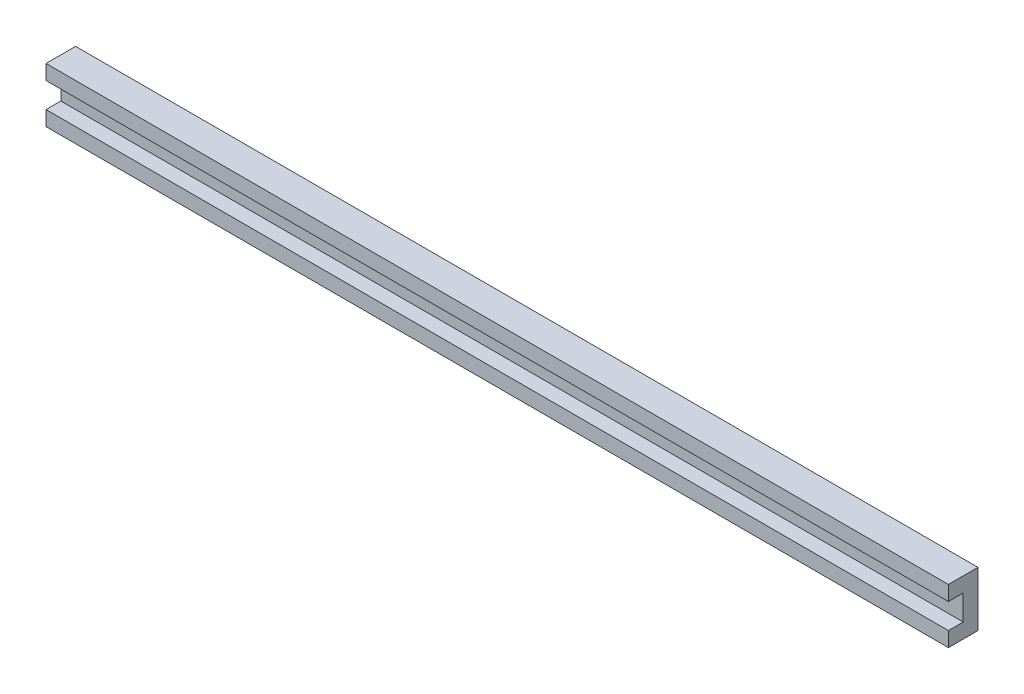
ISO-10303-21;
HEADER;
FILE_DESCRIPTION(('STEP AP214'),'2;1');
FILE_NAME('part.step','',(''),(''),'','','');
FILE_SCHEMA(('AUTOMOTIVE_DESIGN { 1 0 10303 214 1 1 1 1 }'));
ENDSEC;
DATA;
#1=APPLICATION_CONTEXT('core data for automotive mechanical design processes');
#2=APPLICATION_PROTOCOL_DEFINITION('international standard','automotive_design',2000,#1);
#3=PRODUCT_CONTEXT('',#1,'mechanical');
#4=PRODUCT('Part','Part','',(#3));
#5=PRODUCT_RELATED_PRODUCT_CATEGORY('part','',(#4));
#6=PRODUCT_DEFINITION_FORMATION('','',#4);
#7=PRODUCT_DEFINITION_CONTEXT('part definition',#1,'design');
#8=PRODUCT_DEFINITION('design','',#6,#7);
#9=PRODUCT_DEFINITION_SHAPE('','',#8);
#10=(LENGTH_UNIT() NAMED_UNIT(*) SI_UNIT(.MILLI.,.METRE.));
#11=(NAMED_UNIT(*) PLANE_ANGLE_UNIT() SI_UNIT($,.RADIAN.));
#12=(NAMED_UNIT(*) SI_UNIT($,.STERADIAN.) SOLID_ANGLE_UNIT());
#13=UNCERTAINTY_MEASURE_WITH_UNIT(LENGTH_MEASURE(1.E-05),#10,'distance_accuracy_value','');
#14=(GEOMETRIC_REPRESENTATION_CONTEXT(3) GLOBAL_UNCERTAINTY_ASSIGNED_CONTEXT((#13)) GLOBAL_UNIT_ASSIGNED_CONTEXT((#10,
#11,#12)) REPRESENTATION_CONTEXT('',''));
#15=CARTESIAN_POINT('',(0.,0.,0.));
#16=DIRECTION('',(0.,0.,1.));
#17=DIRECTION('',(1.,0.,0.));
#18=AXIS2_PLACEMENT_3D('',#15,#16,#17);
#19=CARTESIAN_POINT('',(1549.4,0.,0.));
#20=DIRECTION('',(0.,0.,-1.));
#21=DIRECTION('',(-1.,0.,0.));
#22=AXIS2_PLACEMENT_3D('',#19,#20,#21);
#23=PLANE('',#22);
#24=DIRECTION('',(0.,-1.,0.));
#25=VECTOR('',#24,1.);
#26=CARTESIAN_POINT('',(0.,0.,0.));
#27=LINE('',#26,#25);
#28=CARTESIAN_POINT('',(0.,25.4,0.));
#29=VERTEX_POINT('',#28);
#30=CARTESIAN_POINT('',(0.,0.,0.));
#31=VERTEX_POINT('',#30);
#32=EDGE_CURVE('E129',#29,#31,#27,.T.);
#33=ORIENTED_EDGE('',*,*,#32,.T.);
#34=DIRECTION('',(-1.,0.,0.));
#35=VECTOR('',#34,1.);
#36=CARTESIAN_POINT('',(1549.4,0.,0.));
#37=LINE('',#36,#35);
#38=CARTESIAN_POINT('',(1549.4,0.,0.));
#39=VERTEX_POINT('',#38);
#40=EDGE_CURVE('E11',#39,#31,#37,.T.);
#41=ORIENTED_EDGE('',*,*,#40,.F.);
#42=DIRECTION('',(0.,-1.,0.));
#43=VECTOR('',#42,1.);
#44=CARTESIAN_POINT('',(1549.4,0.,0.));
#45=LINE('',#44,#43);
#46=CARTESIAN_POINT('',(1549.4,25.4,0.));
#47=VERTEX_POINT('',#46);
#48=EDGE_CURVE('E143',#47,#39,#45,.T.);
#49=ORIENTED_EDGE('',*,*,#48,.F.);
#50=DIRECTION('',(-1.,0.,0.));
#51=VECTOR('',#50,1.);
#52=CARTESIAN_POINT('',(1549.4,25.4,0.));
#53=LINE('',#52,#51);
#54=EDGE_CURVE('E125',#47,#29,#53,.T.);
#55=ORIENTED_EDGE('',*,*,#54,.T.);
#56=EDGE_LOOP('',(#33,#41,#49,#55));
#57=FACE_BOUND('',#56,.T.);
#58=ADVANCED_FACE('F33',(#57),#23,.F.);
#59=CARTESIAN_POINT('',(1549.4,0.,0.));
#60=DIRECTION('',(0.,1.,0.));
#61=DIRECTION('',(0.,0.,1.));
#62=AXIS2_PLACEMENT_3D('',#59,#60,#61);
#63=PLANE('',#62);
#64=DIRECTION('',(0.,0.,-1.));
#65=VECTOR('',#64,1.);
#66=CARTESIAN_POINT('',(0.,0.,0.));
#67=LINE('',#66,#65);
#68=CARTESIAN_POINT('',(0.,0.,-50.8));
#69=VERTEX_POINT('',#68);
#70=EDGE_CURVE('E132',#31,#69,#67,.T.);
#71=ORIENTED_EDGE('',*,*,#70,.T.);
#72=DIRECTION('',(-1.,0.,0.));
#73=VECTOR('',#72,1.);
#74=CARTESIAN_POINT('',(1549.4,0.,-50.8));
#75=LINE('',#74,#73);
#76=CARTESIAN_POINT('',(1549.4,0.,-50.8));
#77=VERTEX_POINT('',#76);
#78=EDGE_CURVE('E41',#77,#69,#75,.T.);
#79=ORIENTED_EDGE('',*,*,#78,.F.);
#80=DIRECTION('',(0.,0.,-1.));
#81=VECTOR('',#80,1.);
#82=CARTESIAN_POINT('',(1549.4,0.,0.));
#83=LINE('',#82,#81);
#84=EDGE_CURVE('E92',#39,#77,#83,.T.);
#85=ORIENTED_EDGE('',*,*,#84,.F.);
#86=ORIENTED_EDGE('',*,*,#40,.T.);
#87=EDGE_LOOP('',(#71,#79,#85,#86));
#88=FACE_BOUND('',#87,.T.);
#89=ADVANCED_FACE('F178',(#88),#63,.F.);
#90=CARTESIAN_POINT('',(1549.4,0.,-50.8));
#91=DIRECTION('',(0.,0.,1.));
#92=DIRECTION('',(0.,-1.,0.));
#93=AXIS2_PLACEMENT_3D('',#90,#91,#92);
#94=PLANE('',#93);
#95=DIRECTION('',(0.,1.,0.));
#96=VECTOR('',#95,1.);
#97=CARTESIAN_POINT('',(0.,0.,-50.8));
#98=LINE('',#97,#96);
#99=CARTESIAN_POINT('',(0.,93.98,-50.8));
#100=VERTEX_POINT('',#99);
#101=EDGE_CURVE('E134',#69,#100,#98,.T.);
#102=ORIENTED_EDGE('',*,*,#101,.T.);
#103=DIRECTION('',(-1.,0.,0.));
#104=VECTOR('',#103,1.);
#105=CARTESIAN_POINT('',(1549.4,93.98,-50.8));
#106=LINE('',#105,#104);
#107=CARTESIAN_POINT('',(1549.4,93.98,-50.8));
#108=VERTEX_POINT('',#107);
#109=EDGE_CURVE('E150',#108,#100,#106,.T.);
#110=ORIENTED_EDGE('',*,*,#109,.F.);
#111=DIRECTION('',(0.,1.,0.));
#112=VECTOR('',#111,1.);
#113=CARTESIAN_POINT('',(1549.4,0.,-50.8));
#114=LINE('',#113,#112);
#115=EDGE_CURVE('E158',#77,#108,#114,.T.);
#116=ORIENTED_EDGE('',*,*,#115,.F.);
#117=ORIENTED_EDGE('',*,*,#78,.T.);
#118=EDGE_LOOP('',(#102,#110,#116,#117));
#119=FACE_BOUND('',#118,.T.);
#120=ADVANCED_FACE('F156',(#119),#94,.F.);
#121=CARTESIAN_POINT('',(1549.4,93.98,-50.8));
#122=DIRECTION('',(0.,-1.,0.));
#123=DIRECTION('',(0.,0.,-1.));
#124=AXIS2_PLACEMENT_3D('',#121,#122,#123);
#125=PLANE('',#124);
#126=DIRECTION('',(0.,0.,1.));
#127=VECTOR('',#126,1.);
#128=CARTESIAN_POINT('',(0.,93.98,-50.8));
#129=LINE('',#128,#127);
#130=CARTESIAN_POINT('',(0.,93.98,0.));
#131=VERTEX_POINT('',#130);
#132=EDGE_CURVE('E136',#100,#131,#129,.T.);
#133=ORIENTED_EDGE('',*,*,#132,.T.);
#134=DIRECTION('',(-1.,0.,0.));
#135=VECTOR('',#134,1.);
#136=CARTESIAN_POINT('',(1549.4,93.98,0.));
#137=LINE('',#136,#135);
#138=CARTESIAN_POINT('',(1549.4,93.98,0.));
#139=VERTEX_POINT('',#138);
#140=EDGE_CURVE('E147',#139,#131,#137,.T.);
#141=ORIENTED_EDGE('',*,*,#140,.F.);
#142=DIRECTION('',(0.,0.,1.));
#143=VECTOR('',#142,1.);
#144=CARTESIAN_POINT('',(1549.4,93.98,-50.8));
#145=LINE('',#144,#143);
#146=EDGE_CURVE('E170',#108,#139,#145,.T.);
#147=ORIENTED_EDGE('',*,*,#146,.F.);
#148=ORIENTED_EDGE('',*,*,#109,.T.);
#149=EDGE_LOOP('',(#133,#141,#147,#148));
#150=FACE_BOUND('',#149,.T.);
#151=ADVANCED_FACE('F166',(#150),#125,.F.);
#152=CARTESIAN_POINT('',(1549.4,93.98,0.));
#153=DIRECTION('',(0.,0.,-1.));
#154=DIRECTION('',(0.,1.,0.));
#155=AXIS2_PLACEMENT_3D('',#152,#153,#154);
#156=PLANE('',#155);
#157=DIRECTION('',(0.,-1.,0.));
#158=VECTOR('',#157,1.);
#159=CARTESIAN_POINT('',(0.,93.98,0.));
#160=LINE('',#159,#158);
#161=CARTESIAN_POINT('',(0.,68.58,0.));
#162=VERTEX_POINT('',#161);
#163=EDGE_CURVE('E138',#131,#162,#160,.T.);
#164=ORIENTED_EDGE('',*,*,#163,.T.);
#165=DIRECTION('',(-1.,0.,0.));
#166=VECTOR('',#165,1.);
#167=CARTESIAN_POINT('',(1549.4,68.58,0.));
#168=LINE('',#167,#166);
#169=CARTESIAN_POINT('',(1549.4,68.58,0.));
#170=VERTEX_POINT('',#169);
#171=EDGE_CURVE('E120',#170,#162,#168,.T.);
#172=ORIENTED_EDGE('',*,*,#171,.F.);
#173=DIRECTION('',(0.,-1.,0.));
#174=VECTOR('',#173,1.);
#175=CARTESIAN_POINT('',(1549.4,93.98,0.));
#176=LINE('',#175,#174);
#177=EDGE_CURVE('E111',#139,#170,#176,.T.);
#178=ORIENTED_EDGE('',*,*,#177,.F.);
#179=ORIENTED_EDGE('',*,*,#140,.T.);
#180=EDGE_LOOP('',(#164,#172,#178,#179));
#181=FACE_BOUND('',#180,.T.);
#182=ADVANCED_FACE('F169',(#181),#156,.F.);
#183=CARTESIAN_POINT('',(1549.4,68.58,-25.4));
#184=DIRECTION('',(0.,1.,0.));
#185=DIRECTION('',(0.,0.,1.));
#186=AXIS2_PLACEMENT_3D('',#183,#184,#185);
#187=PLANE('',#186);
#188=DIRECTION('',(0.,0.,-1.));
#189=VECTOR('',#188,1.);
#190=CARTESIAN_POINT('',(0.,68.58,-25.4));
#191=LINE('',#190,#189);
#192=CARTESIAN_POINT('',(0.,68.58,-25.4));
#193=VERTEX_POINT('',#192);
#194=EDGE_CURVE('E119',#162,#193,#191,.T.);
#195=ORIENTED_EDGE('',*,*,#194,.T.);
#196=DIRECTION('',(-1.,0.,0.));
#197=VECTOR('',#196,1.);
#198=CARTESIAN_POINT('',(1549.4,68.58,-25.4));
#199=LINE('',#198,#197);
#200=CARTESIAN_POINT('',(1549.4,68.58,-25.4));
#201=VERTEX_POINT('',#200);
#202=EDGE_CURVE('E116',#201,#193,#199,.T.);
#203=ORIENTED_EDGE('',*,*,#202,.F.);
#204=DIRECTION('',(0.,0.,-1.));
#205=VECTOR('',#204,1.);
#206=CARTESIAN_POINT('',(1549.4,68.58,-25.4));
#207=LINE('',#206,#205);
#208=EDGE_CURVE('E105',#170,#201,#207,.T.);
#209=ORIENTED_EDGE('',*,*,#208,.F.);
#210=ORIENTED_EDGE('',*,*,#171,.T.);
#211=EDGE_LOOP('',(#195,#203,#209,#210));
#212=FACE_BOUND('',#211,.T.);
#213=ADVANCED_FACE('F117',(#212),#187,.F.);
#214=CARTESIAN_POINT('',(1549.4,25.4,-25.4));
#215=DIRECTION('',(0.,0.,-1.));
#216=DIRECTION('',(-1.,0.,0.));
#217=AXIS2_PLACEMENT_3D('',#214,#215,#216);
#218=PLANE('',#217);
#219=DIRECTION('',(0.,-1.,0.));
#220=VECTOR('',#219,1.);
#221=CARTESIAN_POINT('',(0.,25.4,-25.4));
#222=LINE('',#221,#220);
#223=CARTESIAN_POINT('',(0.,25.4,-25.4));
#224=VERTEX_POINT('',#223);
#225=EDGE_CURVE('E78',#193,#224,#222,.T.);
#226=ORIENTED_EDGE('',*,*,#225,.T.);
#227=DIRECTION('',(-1.,0.,0.));
#228=VECTOR('',#227,1.);
#229=CARTESIAN_POINT('',(1549.4,25.4,-25.4));
#230=LINE('',#229,#228);
#231=CARTESIAN_POINT('',(1549.4,25.4,-25.4));
#232=VERTEX_POINT('',#231);
#233=EDGE_CURVE('E121',#232,#224,#230,.T.);
#234=ORIENTED_EDGE('',*,*,#233,.F.);
#235=DIRECTION('',(0.,-1.,0.));
#236=VECTOR('',#235,1.);
#237=CARTESIAN_POINT('',(1549.4,25.4,-25.4));
#238=LINE('',#237,#236);
#239=EDGE_CURVE('E109',#201,#232,#238,.T.);
#240=ORIENTED_EDGE('',*,*,#239,.F.);
#241=ORIENTED_EDGE('',*,*,#202,.T.);
#242=EDGE_LOOP('',(#226,#234,#240,#241));
#243=FACE_BOUND('',#242,.T.);
#244=ADVANCED_FACE('F123',(#243),#218,.F.);
#245=CARTESIAN_POINT('',(1549.4,25.4,0.));
#246=DIRECTION('',(0.,-1.,0.));
#247=DIRECTION('',(0.,0.,-1.));
#248=AXIS2_PLACEMENT_3D('',#245,#246,#247);
#249=PLANE('',#248);
#250=DIRECTION('',(0.,0.,1.));
#251=VECTOR('',#250,1.);
#252=CARTESIAN_POINT('',(0.,25.4,0.));
#253=LINE('',#252,#251);
#254=EDGE_CURVE('E84',#224,#29,#253,.T.);
#255=ORIENTED_EDGE('',*,*,#254,.T.);
#256=ORIENTED_EDGE('',*,*,#54,.F.);
#257=DIRECTION('',(0.,0.,1.));
#258=VECTOR('',#257,1.);
#259=CARTESIAN_POINT('',(1549.4,25.4,0.));
#260=LINE('',#259,#258);
#261=EDGE_CURVE('E49',#232,#47,#260,.T.);
#262=ORIENTED_EDGE('',*,*,#261,.F.);
#263=ORIENTED_EDGE('',*,*,#233,.T.);
#264=EDGE_LOOP('',(#255,#256,#262,#263));
#265=FACE_BOUND('',#264,.T.);
#266=ADVANCED_FACE('F194',(#265),#249,.F.);
#267=CARTESIAN_POINT('',(1549.4,0.,0.));
#268=DIRECTION('',(-1.,0.,0.));
#269=DIRECTION('',(0.,0.,1.));
#270=AXIS2_PLACEMENT_3D('',#267,#268,#269);
#271=PLANE('',#270);
#272=ORIENTED_EDGE('',*,*,#48,.T.);
#273=ORIENTED_EDGE('',*,*,#84,.T.);
#274=ORIENTED_EDGE('',*,*,#115,.T.);
#275=ORIENTED_EDGE('',*,*,#146,.T.);
#276=ORIENTED_EDGE('',*,*,#177,.T.);
#277=ORIENTED_EDGE('',*,*,#208,.T.);
#278=ORIENTED_EDGE('',*,*,#239,.T.);
#279=ORIENTED_EDGE('',*,*,#261,.T.);
#280=EDGE_LOOP('',(#272,#273,#274,#275,#276,#277,#278,#279));
#281=FACE_BOUND('',#280,.T.);
#282=ADVANCED_FACE('F107',(#281),#271,.F.);
#283=CARTESIAN_POINT('',(0.,0.,0.));
#284=DIRECTION('',(-1.,0.,0.));
#285=DIRECTION('',(0.,0.,1.));
#286=AXIS2_PLACEMENT_3D('',#283,#284,#285);
#287=PLANE('',#286);
#288=ORIENTED_EDGE('',*,*,#32,.F.);
#289=ORIENTED_EDGE('',*,*,#254,.F.);
#290=ORIENTED_EDGE('',*,*,#225,.F.);
#291=ORIENTED_EDGE('',*,*,#194,.F.);
#292=ORIENTED_EDGE('',*,*,#163,.F.);
#293=ORIENTED_EDGE('',*,*,#132,.F.);
#294=ORIENTED_EDGE('',*,*,#101,.F.);
#295=ORIENTED_EDGE('',*,*,#70,.F.);
#296=EDGE_LOOP('',(#288,#289,#290,#291,#292,#293,#294,#295));
#297=FACE_BOUND('',#296,.T.);
#298=ADVANCED_FACE('F162',(#297),#287,.T.);
#299=CLOSED_SHELL('',(#58,#89,#120,#151,#182,#213,#244,#266,#282,#298));
#300=MANIFOLD_SOLID_BREP('B2',#299);
#301=ADVANCED_BREP_SHAPE_REPRESENTATION('',(#18,#300),#14);
#302=SHAPE_DEFINITION_REPRESENTATION(#9,#301);
ENDSEC;
END-ISO-10303-21;
